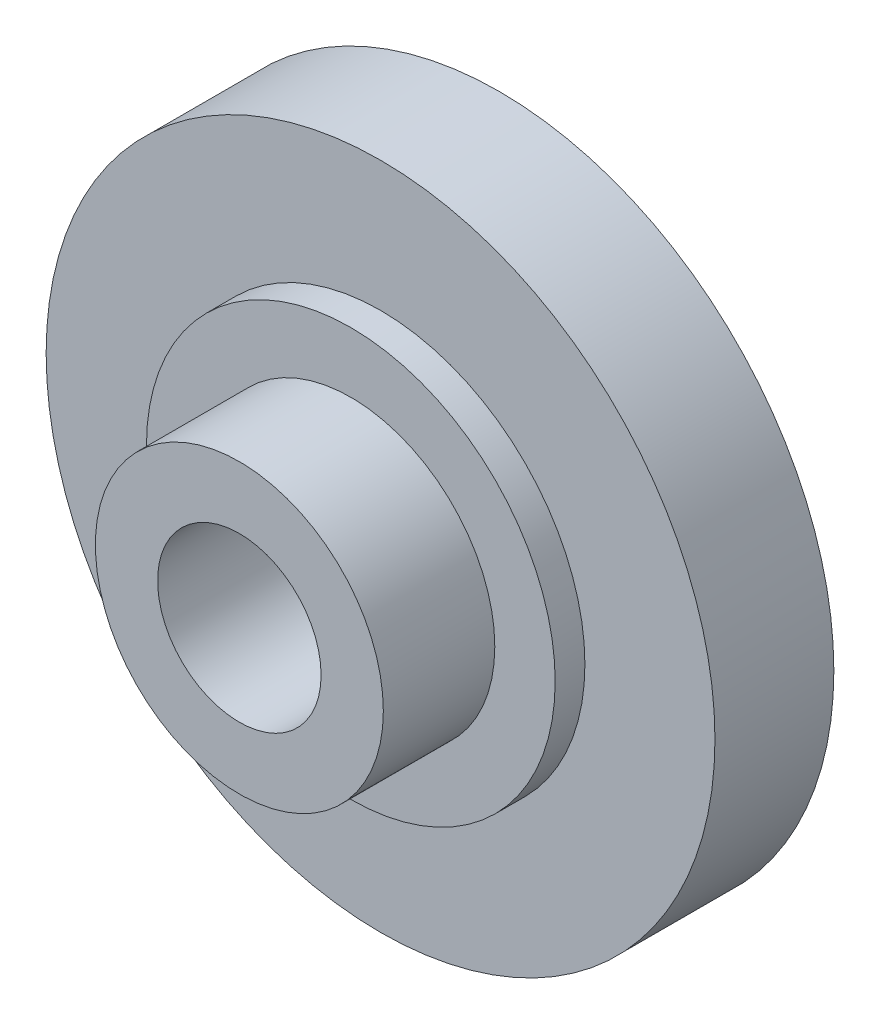
ISO-10303-21;
HEADER;
FILE_DESCRIPTION(('STEP AP214'),'2;1');
FILE_NAME('part.step','',(''),(''),'','','');
FILE_SCHEMA(('AUTOMOTIVE_DESIGN { 1 0 10303 214 1 1 1 1 }'));
ENDSEC;
DATA;
#1=APPLICATION_CONTEXT('core data for automotive mechanical design processes');
#2=APPLICATION_PROTOCOL_DEFINITION('international standard','automotive_design',2000,#1);
#3=PRODUCT_CONTEXT('',#1,'mechanical');
#4=PRODUCT('Part','Part','',(#3));
#5=PRODUCT_RELATED_PRODUCT_CATEGORY('part','',(#4));
#6=PRODUCT_DEFINITION_FORMATION('','',#4);
#7=PRODUCT_DEFINITION_CONTEXT('part definition',#1,'design');
#8=PRODUCT_DEFINITION('design','',#6,#7);
#9=PRODUCT_DEFINITION_SHAPE('','',#8);
#10=(LENGTH_UNIT() NAMED_UNIT(*) SI_UNIT(.MILLI.,.METRE.));
#11=(NAMED_UNIT(*) PLANE_ANGLE_UNIT() SI_UNIT($,.RADIAN.));
#12=(NAMED_UNIT(*) SI_UNIT($,.STERADIAN.) SOLID_ANGLE_UNIT());
#13=UNCERTAINTY_MEASURE_WITH_UNIT(LENGTH_MEASURE(1.E-05),#10,'distance_accuracy_value','');
#14=(GEOMETRIC_REPRESENTATION_CONTEXT(3) GLOBAL_UNCERTAINTY_ASSIGNED_CONTEXT((#13)) GLOBAL_UNIT_ASSIGNED_CONTEXT((#10,
#11,#12)) REPRESENTATION_CONTEXT('',''));
#15=CARTESIAN_POINT('',(0.,0.,0.));
#16=DIRECTION('',(0.,0.,1.));
#17=DIRECTION('',(1.,0.,0.));
#18=AXIS2_PLACEMENT_3D('',#15,#16,#17);
#19=CARTESIAN_POINT('',(0.,0.,7.));
#20=DIRECTION('',(0.,0.,1.));
#21=DIRECTION('',(1.,0.,0.));
#22=AXIS2_PLACEMENT_3D('',#19,#20,#21);
#23=PLANE('',#22);
#24=CARTESIAN_POINT('',(0.,0.,7.));
#25=DIRECTION('',(0.,0.,1.));
#26=DIRECTION('',(1.,0.,0.));
#27=AXIS2_PLACEMENT_3D('',#24,#25,#26);
#28=CIRCLE('',#27,2.2);
#29=CARTESIAN_POINT('',(2.2,0.,7.));
#30=VERTEX_POINT('',#29);
#31=EDGE_CURVE('E37',#30,#30,#28,.T.);
#32=ORIENTED_EDGE('',*,*,#31,.F.);
#33=EDGE_LOOP('',(#32));
#34=FACE_BOUND('',#33,.T.);
#35=CARTESIAN_POINT('',(0.,0.,7.));
#36=DIRECTION('',(0.,0.,1.));
#37=DIRECTION('',(1.,0.,0.));
#38=AXIS2_PLACEMENT_3D('',#35,#36,#37);
#39=CIRCLE('',#38,3.875);
#40=CARTESIAN_POINT('',(3.875,0.,7.));
#41=VERTEX_POINT('',#40);
#42=EDGE_CURVE('E57',#41,#41,#39,.T.);
#43=ORIENTED_EDGE('',*,*,#42,.T.);
#44=EDGE_LOOP('',(#43));
#45=FACE_BOUND('',#44,.T.);
#46=ADVANCED_FACE('F30',(#34,#45),#23,.T.);
#47=CARTESIAN_POINT('',(0.,0.,3.2));
#48=DIRECTION('',(0.,0.,1.));
#49=DIRECTION('',(1.,0.,0.));
#50=AXIS2_PLACEMENT_3D('',#47,#48,#49);
#51=CYLINDRICAL_SURFACE('',#50,5.5);
#52=CARTESIAN_POINT('',(0.,0.,3.2));
#53=DIRECTION('',(0.,0.,1.));
#54=DIRECTION('',(1.,0.,0.));
#55=AXIS2_PLACEMENT_3D('',#52,#53,#54);
#56=CIRCLE('',#55,5.5);
#57=CARTESIAN_POINT('',(5.5,0.,3.2));
#58=VERTEX_POINT('',#57);
#59=EDGE_CURVE('E50',#58,#58,#56,.T.);
#60=ORIENTED_EDGE('',*,*,#59,.T.);
#61=EDGE_LOOP('',(#60));
#62=FACE_BOUND('',#61,.T.);
#63=CARTESIAN_POINT('',(0.,0.,4.));
#64=DIRECTION('',(0.,0.,1.));
#65=DIRECTION('',(1.,0.,0.));
#66=AXIS2_PLACEMENT_3D('',#63,#64,#65);
#67=CIRCLE('',#66,5.5);
#68=CARTESIAN_POINT('',(5.5,0.,4.));
#69=VERTEX_POINT('',#68);
#70=EDGE_CURVE('E53',#69,#69,#67,.T.);
#71=ORIENTED_EDGE('',*,*,#70,.F.);
#72=EDGE_LOOP('',(#71));
#73=FACE_BOUND('',#72,.T.);
#74=ADVANCED_FACE('F73',(#62,#73),#51,.T.);
#75=CARTESIAN_POINT('',(0.,0.,7.));
#76=DIRECTION('',(0.,0.,-1.));
#77=DIRECTION('',(-1.,0.,0.));
#78=AXIS2_PLACEMENT_3D('',#75,#76,#77);
#79=CYLINDRICAL_SURFACE('',#78,9.);
#80=CARTESIAN_POINT('',(0.,0.,0.));
#81=DIRECTION('',(0.,0.,1.));
#82=DIRECTION('',(1.,0.,0.));
#83=AXIS2_PLACEMENT_3D('',#80,#81,#82);
#84=CIRCLE('',#83,9.);
#85=CARTESIAN_POINT('',(9.,0.,0.));
#86=VERTEX_POINT('',#85);
#87=EDGE_CURVE('E10',#86,#86,#84,.T.);
#88=ORIENTED_EDGE('',*,*,#87,.T.);
#89=EDGE_LOOP('',(#88));
#90=FACE_BOUND('',#89,.T.);
#91=CARTESIAN_POINT('',(0.,0.,3.2));
#92=DIRECTION('',(0.,0.,1.));
#93=DIRECTION('',(1.,0.,0.));
#94=AXIS2_PLACEMENT_3D('',#91,#92,#93);
#95=CIRCLE('',#94,9.);
#96=CARTESIAN_POINT('',(9.,0.,3.2));
#97=VERTEX_POINT('',#96);
#98=EDGE_CURVE('E46',#97,#97,#95,.T.);
#99=ORIENTED_EDGE('',*,*,#98,.F.);
#100=EDGE_LOOP('',(#99));
#101=FACE_BOUND('',#100,.T.);
#102=ADVANCED_FACE('F32',(#90,#101),#79,.T.);
#103=CARTESIAN_POINT('',(0.,0.,0.));
#104=DIRECTION('',(0.,0.,1.));
#105=DIRECTION('',(1.,0.,0.));
#106=AXIS2_PLACEMENT_3D('',#103,#104,#105);
#107=PLANE('',#106);
#108=ORIENTED_EDGE('',*,*,#87,.F.);
#109=EDGE_LOOP('',(#108));
#110=FACE_BOUND('',#109,.T.);
#111=CARTESIAN_POINT('',(0.,0.,0.));
#112=DIRECTION('',(0.,0.,1.));
#113=DIRECTION('',(1.,0.,0.));
#114=AXIS2_PLACEMENT_3D('',#111,#112,#113);
#115=CIRCLE('',#114,2.2);
#116=CARTESIAN_POINT('',(2.2,0.,0.));
#117=VERTEX_POINT('',#116);
#118=EDGE_CURVE('E41',#117,#117,#115,.T.);
#119=ORIENTED_EDGE('',*,*,#118,.T.);
#120=EDGE_LOOP('',(#119));
#121=FACE_BOUND('',#120,.T.);
#122=ADVANCED_FACE('F81',(#110,#121),#107,.F.);
#123=CARTESIAN_POINT('',(0.,0.,7.));
#124=DIRECTION('',(0.,0.,-1.));
#125=DIRECTION('',(-1.,0.,0.));
#126=AXIS2_PLACEMENT_3D('',#123,#124,#125);
#127=CYLINDRICAL_SURFACE('',#126,2.2);
#128=ORIENTED_EDGE('',*,*,#31,.T.);
#129=EDGE_LOOP('',(#128));
#130=FACE_BOUND('',#129,.T.);
#131=ORIENTED_EDGE('',*,*,#118,.F.);
#132=EDGE_LOOP('',(#131));
#133=FACE_BOUND('',#132,.T.);
#134=ADVANCED_FACE('F88',(#130,#133),#127,.F.);
#135=CARTESIAN_POINT('',(0.,0.,3.2));
#136=DIRECTION('',(0.,0.,1.));
#137=DIRECTION('',(1.,0.,0.));
#138=AXIS2_PLACEMENT_3D('',#135,#136,#137);
#139=PLANE('',#138);
#140=ORIENTED_EDGE('',*,*,#59,.F.);
#141=EDGE_LOOP('',(#140));
#142=FACE_BOUND('',#141,.T.);
#143=ORIENTED_EDGE('',*,*,#98,.T.);
#144=EDGE_LOOP('',(#143));
#145=FACE_BOUND('',#144,.T.);
#146=ADVANCED_FACE('F69',(#142,#145),#139,.T.);
#147=CARTESIAN_POINT('',(0.,0.,4.));
#148=DIRECTION('',(0.,0.,1.));
#149=DIRECTION('',(1.,0.,0.));
#150=AXIS2_PLACEMENT_3D('',#147,#148,#149);
#151=PLANE('',#150);
#152=CARTESIAN_POINT('',(0.,0.,4.));
#153=DIRECTION('',(0.,0.,1.));
#154=DIRECTION('',(1.,0.,0.));
#155=AXIS2_PLACEMENT_3D('',#152,#153,#154);
#156=CIRCLE('',#155,3.875);
#157=CARTESIAN_POINT('',(3.875,0.,4.));
#158=VERTEX_POINT('',#157);
#159=EDGE_CURVE('E56',#158,#158,#156,.T.);
#160=ORIENTED_EDGE('',*,*,#159,.F.);
#161=EDGE_LOOP('',(#160));
#162=FACE_BOUND('',#161,.T.);
#163=ORIENTED_EDGE('',*,*,#70,.T.);
#164=EDGE_LOOP('',(#163));
#165=FACE_BOUND('',#164,.T.);
#166=ADVANCED_FACE('F66',(#162,#165),#151,.T.);
#167=CARTESIAN_POINT('',(0.,0.,4.));
#168=DIRECTION('',(0.,0.,1.));
#169=DIRECTION('',(1.,0.,0.));
#170=AXIS2_PLACEMENT_3D('',#167,#168,#169);
#171=CYLINDRICAL_SURFACE('',#170,3.875);
#172=ORIENTED_EDGE('',*,*,#159,.T.);
#173=EDGE_LOOP('',(#172));
#174=FACE_BOUND('',#173,.T.);
#175=ORIENTED_EDGE('',*,*,#42,.F.);
#176=EDGE_LOOP('',(#175));
#177=FACE_BOUND('',#176,.T.);
#178=ADVANCED_FACE('F63',(#174,#177),#171,.T.);
#179=CLOSED_SHELL('',(#46,#74,#102,#122,#134,#146,#166,#178));
#180=MANIFOLD_SOLID_BREP('B2',#179);
#181=ADVANCED_BREP_SHAPE_REPRESENTATION('',(#18,#180),#14);
#182=SHAPE_DEFINITION_REPRESENTATION(#9,#181);
ENDSEC;
END-ISO-10303-21;
